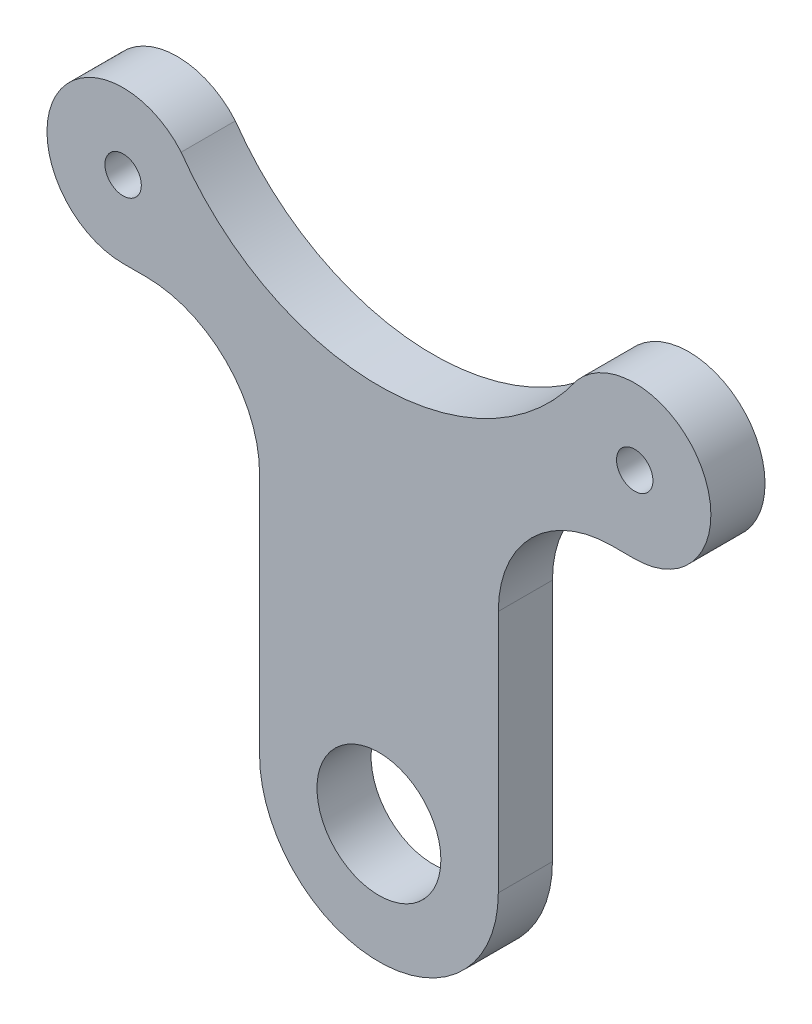
ISO-10303-21;
HEADER;
FILE_DESCRIPTION(('STEP AP214'),'2;1');
FILE_NAME('part.step','',(''),(''),'','','');
FILE_SCHEMA(('AUTOMOTIVE_DESIGN { 1 0 10303 214 1 1 1 1 }'));
ENDSEC;
DATA;
#1=APPLICATION_CONTEXT('core data for automotive mechanical design processes');
#2=APPLICATION_PROTOCOL_DEFINITION('international standard','automotive_design',2000,#1);
#3=PRODUCT_CONTEXT('',#1,'mechanical');
#4=PRODUCT('Part','Part','',(#3));
#5=PRODUCT_RELATED_PRODUCT_CATEGORY('part','',(#4));
#6=PRODUCT_DEFINITION_FORMATION('','',#4);
#7=PRODUCT_DEFINITION_CONTEXT('part definition',#1,'design');
#8=PRODUCT_DEFINITION('design','',#6,#7);
#9=PRODUCT_DEFINITION_SHAPE('','',#8);
#10=(LENGTH_UNIT() NAMED_UNIT(*) SI_UNIT(.MILLI.,.METRE.));
#11=(NAMED_UNIT(*) PLANE_ANGLE_UNIT() SI_UNIT($,.RADIAN.));
#12=(NAMED_UNIT(*) SI_UNIT($,.STERADIAN.) SOLID_ANGLE_UNIT());
#13=UNCERTAINTY_MEASURE_WITH_UNIT(LENGTH_MEASURE(1.E-05),#10,'distance_accuracy_value','');
#14=(GEOMETRIC_REPRESENTATION_CONTEXT(3) GLOBAL_UNCERTAINTY_ASSIGNED_CONTEXT((#13)) GLOBAL_UNIT_ASSIGNED_CONTEXT((#10,
#11,#12)) REPRESENTATION_CONTEXT('',''));
#15=CARTESIAN_POINT('',(0.,0.,0.));
#16=DIRECTION('',(0.,0.,1.));
#17=DIRECTION('',(1.,0.,0.));
#18=AXIS2_PLACEMENT_3D('',#15,#16,#17);
#19=CARTESIAN_POINT('',(0.,31.439339413153,4.763));
#20=DIRECTION('',(0.,1.,0.));
#21=DIRECTION('',(0.,0.,1.));
#22=AXIS2_PLACEMENT_3D('',#19,#20,#21);
#23=PLANE('',#22);
#24=DIRECTION('',(1.,0.,0.));
#25=VECTOR('',#24,1.);
#26=CARTESIAN_POINT('',(0.,31.439339413153,0.));
#27=LINE('',#26,#25);
#28=CARTESIAN_POINT('',(20.5,31.439339413153,0.));
#29=VERTEX_POINT('',#28);
#30=CARTESIAN_POINT('',(22.5,31.439339413153,0.));
#31=VERTEX_POINT('',#30);
#32=EDGE_CURVE('E160',#29,#31,#27,.T.);
#33=ORIENTED_EDGE('',*,*,#32,.T.);
#34=DIRECTION('',(0.,0.,-1.));
#35=VECTOR('',#34,1.);
#36=CARTESIAN_POINT('',(22.5,31.439339413153,4.763));
#37=LINE('',#36,#35);
#38=CARTESIAN_POINT('',(22.5,31.439339413153,4.763));
#39=VERTEX_POINT('',#38);
#40=EDGE_CURVE('E12',#39,#31,#37,.T.);
#41=ORIENTED_EDGE('',*,*,#40,.F.);
#42=DIRECTION('',(1.,0.,0.));
#43=VECTOR('',#42,1.);
#44=CARTESIAN_POINT('',(0.,31.439339413153,4.763));
#45=LINE('',#44,#43);
#46=CARTESIAN_POINT('',(20.5,31.439339413153,4.763));
#47=VERTEX_POINT('',#46);
#48=EDGE_CURVE('E189',#47,#39,#45,.T.);
#49=ORIENTED_EDGE('',*,*,#48,.F.);
#50=DIRECTION('',(0.,0.,-1.));
#51=VECTOR('',#50,1.);
#52=CARTESIAN_POINT('',(20.5,31.439339413153,4.763));
#53=LINE('',#52,#51);
#54=EDGE_CURVE('E151',#47,#29,#53,.T.);
#55=ORIENTED_EDGE('',*,*,#54,.T.);
#56=EDGE_LOOP('',(#33,#41,#49,#55));
#57=FACE_BOUND('',#56,.T.);
#58=ADVANCED_FACE('F46',(#57),#23,.F.);
#59=CARTESIAN_POINT('',(22.5,38.139339413153,4.763));
#60=DIRECTION('',(0.,0.,-1.));
#61=DIRECTION('',(-1.,0.,0.));
#62=AXIS2_PLACEMENT_3D('',#59,#60,#61);
#63=CYLINDRICAL_SURFACE('',#62,6.7);
#64=CARTESIAN_POINT('',(22.5,38.139339413153,0.));
#65=DIRECTION('',(0.,0.,1.));
#66=DIRECTION('',(1.,0.,0.));
#67=AXIS2_PLACEMENT_3D('',#64,#65,#66);
#68=CIRCLE('',#67,6.7);
#69=CARTESIAN_POINT('',(17.3951551088407,42.4787585721193,0.));
#70=VERTEX_POINT('',#69);
#71=EDGE_CURVE('E231',#31,#70,#68,.T.);
#72=ORIENTED_EDGE('',*,*,#71,.T.);
#73=DIRECTION('',(0.,0.,-1.));
#74=VECTOR('',#73,1.);
#75=CARTESIAN_POINT('',(17.3951551088407,42.4787585721193,4.763));
#76=LINE('',#75,#74);
#77=CARTESIAN_POINT('',(17.3951551088407,42.4787585721193,4.763));
#78=VERTEX_POINT('',#77);
#79=EDGE_CURVE('E55',#78,#70,#76,.T.);
#80=ORIENTED_EDGE('',*,*,#79,.F.);
#81=CARTESIAN_POINT('',(22.5,38.139339413153,4.763));
#82=DIRECTION('',(0.,0.,1.));
#83=DIRECTION('',(1.,0.,0.));
#84=AXIS2_PLACEMENT_3D('',#81,#82,#83);
#85=CIRCLE('',#84,6.7);
#86=EDGE_CURVE('E108',#39,#78,#85,.T.);
#87=ORIENTED_EDGE('',*,*,#86,.F.);
#88=ORIENTED_EDGE('',*,*,#40,.T.);
#89=EDGE_LOOP('',(#72,#80,#87,#88));
#90=FACE_BOUND('',#89,.T.);
#91=ADVANCED_FACE('F232',(#90),#63,.T.);
#92=CARTESIAN_POINT('',(0.,54.5440320324155,4.763));
#93=DIRECTION('',(0.,0.,-1.));
#94=DIRECTION('',(-1.,0.,0.));
#95=AXIS2_PLACEMENT_3D('',#92,#93,#94);
#96=CYLINDRICAL_SURFACE('',#95,21.1698428178471);
#97=CARTESIAN_POINT('',(0.,54.5440320324155,0.));
#98=DIRECTION('',(0.,0.,1.));
#99=DIRECTION('',(1.,0.,0.));
#100=AXIS2_PLACEMENT_3D('',#97,#98,#99);
#101=CIRCLE('',#100,21.1698428178471);
#102=CARTESIAN_POINT('',(-17.3951551088407,42.4787585721194,0.));
#103=VERTEX_POINT('',#102);
#104=EDGE_CURVE('E230',#103,#70,#101,.T.);
#105=ORIENTED_EDGE('',*,*,#104,.F.);
#106=DIRECTION('',(0.,0.,-1.));
#107=VECTOR('',#106,1.);
#108=CARTESIAN_POINT('',(-17.3951551088407,42.4787585721194,4.763));
#109=LINE('',#108,#107);
#110=CARTESIAN_POINT('',(-17.3951551088407,42.4787585721194,4.763));
#111=VERTEX_POINT('',#110);
#112=EDGE_CURVE('E220',#111,#103,#109,.T.);
#113=ORIENTED_EDGE('',*,*,#112,.F.);
#114=CARTESIAN_POINT('',(0.,54.5440320324155,4.763));
#115=DIRECTION('',(0.,0.,1.));
#116=DIRECTION('',(1.,0.,0.));
#117=AXIS2_PLACEMENT_3D('',#114,#115,#116);
#118=CIRCLE('',#117,21.1698428178471);
#119=EDGE_CURVE('E192',#111,#78,#118,.T.);
#120=ORIENTED_EDGE('',*,*,#119,.T.);
#121=ORIENTED_EDGE('',*,*,#79,.T.);
#122=EDGE_LOOP('',(#105,#113,#120,#121));
#123=FACE_BOUND('',#122,.T.);
#124=ADVANCED_FACE('F228',(#123),#96,.F.);
#125=CARTESIAN_POINT('',(-22.5,38.139339413153,4.763));
#126=DIRECTION('',(0.,0.,-1.));
#127=DIRECTION('',(-1.,0.,0.));
#128=AXIS2_PLACEMENT_3D('',#125,#126,#127);
#129=CYLINDRICAL_SURFACE('',#128,6.7);
#130=CARTESIAN_POINT('',(-22.5,38.139339413153,0.));
#131=DIRECTION('',(0.,0.,1.));
#132=DIRECTION('',(1.,0.,0.));
#133=AXIS2_PLACEMENT_3D('',#130,#131,#132);
#134=CIRCLE('',#133,6.7);
#135=CARTESIAN_POINT('',(-22.5,31.439339413153,0.));
#136=VERTEX_POINT('',#135);
#137=EDGE_CURVE('E240',#103,#136,#134,.T.);
#138=ORIENTED_EDGE('',*,*,#137,.T.);
#139=DIRECTION('',(0.,0.,-1.));
#140=VECTOR('',#139,1.);
#141=CARTESIAN_POINT('',(-22.5,31.439339413153,4.763));
#142=LINE('',#141,#140);
#143=CARTESIAN_POINT('',(-22.5,31.439339413153,4.763));
#144=VERTEX_POINT('',#143);
#145=EDGE_CURVE('E218',#144,#136,#142,.T.);
#146=ORIENTED_EDGE('',*,*,#145,.F.);
#147=CARTESIAN_POINT('',(-22.5,38.139339413153,4.763));
#148=DIRECTION('',(0.,0.,1.));
#149=DIRECTION('',(1.,0.,0.));
#150=AXIS2_PLACEMENT_3D('',#147,#148,#149);
#151=CIRCLE('',#150,6.7);
#152=EDGE_CURVE('E195',#111,#144,#151,.T.);
#153=ORIENTED_EDGE('',*,*,#152,.F.);
#154=ORIENTED_EDGE('',*,*,#112,.T.);
#155=EDGE_LOOP('',(#138,#146,#153,#154));
#156=FACE_BOUND('',#155,.T.);
#157=ADVANCED_FACE('F301',(#156),#129,.T.);
#158=CARTESIAN_POINT('',(0.,31.439339413153,4.763));
#159=DIRECTION('',(0.,1.,0.));
#160=DIRECTION('',(0.,0.,1.));
#161=AXIS2_PLACEMENT_3D('',#158,#159,#160);
#162=PLANE('',#161);
#163=DIRECTION('',(1.,0.,0.));
#164=VECTOR('',#163,1.);
#165=CARTESIAN_POINT('',(0.,31.439339413153,0.));
#166=LINE('',#165,#164);
#167=CARTESIAN_POINT('',(-20.5,31.439339413153,0.));
#168=VERTEX_POINT('',#167);
#169=EDGE_CURVE('E216',#136,#168,#166,.T.);
#170=ORIENTED_EDGE('',*,*,#169,.T.);
#171=DIRECTION('',(0.,0.,-1.));
#172=VECTOR('',#171,1.);
#173=CARTESIAN_POINT('',(-20.5,31.439339413153,4.763));
#174=LINE('',#173,#172);
#175=CARTESIAN_POINT('',(-20.5,31.439339413153,4.763));
#176=VERTEX_POINT('',#175);
#177=EDGE_CURVE('E205',#176,#168,#174,.T.);
#178=ORIENTED_EDGE('',*,*,#177,.F.);
#179=DIRECTION('',(1.,0.,0.));
#180=VECTOR('',#179,1.);
#181=CARTESIAN_POINT('',(0.,31.439339413153,4.763));
#182=LINE('',#181,#180);
#183=EDGE_CURVE('E197',#144,#176,#182,.T.);
#184=ORIENTED_EDGE('',*,*,#183,.F.);
#185=ORIENTED_EDGE('',*,*,#145,.T.);
#186=EDGE_LOOP('',(#170,#178,#184,#185));
#187=FACE_BOUND('',#186,.T.);
#188=ADVANCED_FACE('F214',(#187),#162,.F.);
#189=CARTESIAN_POINT('',(-20.5,21.439339413153,4.763));
#190=DIRECTION('',(0.,0.,-1.));
#191=DIRECTION('',(-1.,0.,0.));
#192=AXIS2_PLACEMENT_3D('',#189,#190,#191);
#193=CYLINDRICAL_SURFACE('',#192,10.);
#194=CARTESIAN_POINT('',(-20.5,21.439339413153,0.));
#195=DIRECTION('',(0.,0.,1.));
#196=DIRECTION('',(1.,0.,0.));
#197=AXIS2_PLACEMENT_3D('',#194,#195,#196);
#198=CIRCLE('',#197,10.);
#199=CARTESIAN_POINT('',(-10.5,21.439339413153,0.));
#200=VERTEX_POINT('',#199);
#201=EDGE_CURVE('E259',#200,#168,#198,.T.);
#202=ORIENTED_EDGE('',*,*,#201,.F.);
#203=DIRECTION('',(0.,0.,-1.));
#204=VECTOR('',#203,1.);
#205=CARTESIAN_POINT('',(-10.5,21.439339413153,4.763));
#206=LINE('',#205,#204);
#207=CARTESIAN_POINT('',(-10.5,21.439339413153,4.763));
#208=VERTEX_POINT('',#207);
#209=EDGE_CURVE('E207',#208,#200,#206,.T.);
#210=ORIENTED_EDGE('',*,*,#209,.F.);
#211=CARTESIAN_POINT('',(-20.5,21.439339413153,4.763));
#212=DIRECTION('',(0.,0.,1.));
#213=DIRECTION('',(1.,0.,0.));
#214=AXIS2_PLACEMENT_3D('',#211,#212,#213);
#215=CIRCLE('',#214,10.);
#216=EDGE_CURVE('E199',#208,#176,#215,.T.);
#217=ORIENTED_EDGE('',*,*,#216,.T.);
#218=ORIENTED_EDGE('',*,*,#177,.T.);
#219=EDGE_LOOP('',(#202,#210,#217,#218));
#220=FACE_BOUND('',#219,.T.);
#221=ADVANCED_FACE('F203',(#220),#193,.F.);
#222=CARTESIAN_POINT('',(-10.5,0.,4.763));
#223=DIRECTION('',(1.,0.,0.));
#224=DIRECTION('',(0.,1.,0.));
#225=AXIS2_PLACEMENT_3D('',#222,#223,#224);
#226=PLANE('',#225);
#227=DIRECTION('',(0.,-1.,0.));
#228=VECTOR('',#227,1.);
#229=CARTESIAN_POINT('',(-10.5,0.,0.));
#230=LINE('',#229,#228);
#231=CARTESIAN_POINT('',(-10.5,0.,0.));
#232=VERTEX_POINT('',#231);
#233=EDGE_CURVE('E263',#200,#232,#230,.T.);
#234=ORIENTED_EDGE('',*,*,#233,.T.);
#235=DIRECTION('',(0.,0.,-1.));
#236=VECTOR('',#235,1.);
#237=CARTESIAN_POINT('',(-10.5,0.,4.763));
#238=LINE('',#237,#236);
#239=CARTESIAN_POINT('',(-10.5,0.,4.763));
#240=VERTEX_POINT('',#239);
#241=EDGE_CURVE('E147',#240,#232,#238,.T.);
#242=ORIENTED_EDGE('',*,*,#241,.F.);
#243=DIRECTION('',(0.,-1.,0.));
#244=VECTOR('',#243,1.);
#245=CARTESIAN_POINT('',(-10.5,0.,4.763));
#246=LINE('',#245,#244);
#247=EDGE_CURVE('E134',#208,#240,#246,.T.);
#248=ORIENTED_EDGE('',*,*,#247,.F.);
#249=ORIENTED_EDGE('',*,*,#209,.T.);
#250=EDGE_LOOP('',(#234,#242,#248,#249));
#251=FACE_BOUND('',#250,.T.);
#252=ADVANCED_FACE('F309',(#251),#226,.F.);
#253=CARTESIAN_POINT('',(0.,0.,4.763));
#254=DIRECTION('',(0.,0.,-1.));
#255=DIRECTION('',(-1.,0.,0.));
#256=AXIS2_PLACEMENT_3D('',#253,#254,#255);
#257=CYLINDRICAL_SURFACE('',#256,10.5);
#258=CARTESIAN_POINT('',(0.,0.,0.));
#259=DIRECTION('',(0.,0.,1.));
#260=DIRECTION('',(1.,0.,0.));
#261=AXIS2_PLACEMENT_3D('',#258,#259,#260);
#262=CIRCLE('',#261,10.5);
#263=CARTESIAN_POINT('',(10.5,0.,0.));
#264=VERTEX_POINT('',#263);
#265=EDGE_CURVE('E143',#232,#264,#262,.T.);
#266=ORIENTED_EDGE('',*,*,#265,.T.);
#267=DIRECTION('',(0.,0.,-1.));
#268=VECTOR('',#267,1.);
#269=CARTESIAN_POINT('',(10.5,0.,4.763));
#270=LINE('',#269,#268);
#271=CARTESIAN_POINT('',(10.5,0.,4.763));
#272=VERTEX_POINT('',#271);
#273=EDGE_CURVE('E140',#272,#264,#270,.T.);
#274=ORIENTED_EDGE('',*,*,#273,.F.);
#275=CARTESIAN_POINT('',(0.,0.,4.763));
#276=DIRECTION('',(0.,0.,1.));
#277=DIRECTION('',(1.,0.,0.));
#278=AXIS2_PLACEMENT_3D('',#275,#276,#277);
#279=CIRCLE('',#278,10.5);
#280=EDGE_CURVE('E127',#240,#272,#279,.T.);
#281=ORIENTED_EDGE('',*,*,#280,.F.);
#282=ORIENTED_EDGE('',*,*,#241,.T.);
#283=EDGE_LOOP('',(#266,#274,#281,#282));
#284=FACE_BOUND('',#283,.T.);
#285=ADVANCED_FACE('F141',(#284),#257,.T.);
#286=CARTESIAN_POINT('',(10.5,0.,4.763));
#287=DIRECTION('',(1.,0.,0.));
#288=DIRECTION('',(0.,1.,0.));
#289=AXIS2_PLACEMENT_3D('',#286,#287,#288);
#290=PLANE('',#289);
#291=DIRECTION('',(0.,-1.,0.));
#292=VECTOR('',#291,1.);
#293=CARTESIAN_POINT('',(10.5,0.,0.));
#294=LINE('',#293,#292);
#295=CARTESIAN_POINT('',(10.5,21.439339413153,0.));
#296=VERTEX_POINT('',#295);
#297=EDGE_CURVE('E269',#296,#264,#294,.T.);
#298=ORIENTED_EDGE('',*,*,#297,.F.);
#299=DIRECTION('',(0.,0.,-1.));
#300=VECTOR('',#299,1.);
#301=CARTESIAN_POINT('',(10.5,21.439339413153,4.763));
#302=LINE('',#301,#300);
#303=CARTESIAN_POINT('',(10.5,21.439339413153,4.763));
#304=VERTEX_POINT('',#303);
#305=EDGE_CURVE('E97',#304,#296,#302,.T.);
#306=ORIENTED_EDGE('',*,*,#305,.F.);
#307=DIRECTION('',(0.,-1.,0.));
#308=VECTOR('',#307,1.);
#309=CARTESIAN_POINT('',(10.5,0.,4.763));
#310=LINE('',#309,#308);
#311=EDGE_CURVE('E131',#304,#272,#310,.T.);
#312=ORIENTED_EDGE('',*,*,#311,.T.);
#313=ORIENTED_EDGE('',*,*,#273,.T.);
#314=EDGE_LOOP('',(#298,#306,#312,#313));
#315=FACE_BOUND('',#314,.T.);
#316=ADVANCED_FACE('F149',(#315),#290,.T.);
#317=CARTESIAN_POINT('',(0.,0.,4.763));
#318=DIRECTION('',(0.,0.,-1.));
#319=DIRECTION('',(-1.,0.,0.));
#320=AXIS2_PLACEMENT_3D('',#317,#318,#319);
#321=CYLINDRICAL_SURFACE('',#320,5.44942);
#322=CARTESIAN_POINT('',(0.,0.,4.763));
#323=DIRECTION('',(0.,0.,1.));
#324=DIRECTION('',(1.,0.,0.));
#325=AXIS2_PLACEMENT_3D('',#322,#323,#324);
#326=CIRCLE('',#325,5.44942);
#327=CARTESIAN_POINT('',(5.44942,0.,4.763));
#328=VERTEX_POINT('',#327);
#329=EDGE_CURVE('E186',#328,#328,#326,.T.);
#330=ORIENTED_EDGE('',*,*,#329,.T.);
#331=EDGE_LOOP('',(#330));
#332=FACE_BOUND('',#331,.T.);
#333=CARTESIAN_POINT('',(0.,0.,0.));
#334=DIRECTION('',(0.,0.,1.));
#335=DIRECTION('',(1.,0.,0.));
#336=AXIS2_PLACEMENT_3D('',#333,#334,#335);
#337=CIRCLE('',#336,5.44942);
#338=CARTESIAN_POINT('',(5.44942,0.,0.));
#339=VERTEX_POINT('',#338);
#340=EDGE_CURVE('E155',#339,#339,#337,.T.);
#341=ORIENTED_EDGE('',*,*,#340,.F.);
#342=EDGE_LOOP('',(#341));
#343=FACE_BOUND('',#342,.T.);
#344=ADVANCED_FACE('F48',(#332,#343),#321,.F.);
#345=CARTESIAN_POINT('',(20.5,21.439339413153,4.763));
#346=DIRECTION('',(0.,0.,-1.));
#347=DIRECTION('',(-1.,0.,0.));
#348=AXIS2_PLACEMENT_3D('',#345,#346,#347);
#349=CYLINDRICAL_SURFACE('',#348,10.);
#350=CARTESIAN_POINT('',(20.5,21.439339413153,0.));
#351=DIRECTION('',(0.,0.,1.));
#352=DIRECTION('',(1.,0.,0.));
#353=AXIS2_PLACEMENT_3D('',#350,#351,#352);
#354=CIRCLE('',#353,10.);
#355=EDGE_CURVE('E100',#296,#29,#354,.F.);
#356=ORIENTED_EDGE('',*,*,#355,.T.);
#357=ORIENTED_EDGE('',*,*,#54,.F.);
#358=CARTESIAN_POINT('',(20.5,21.439339413153,4.763));
#359=DIRECTION('',(0.,0.,1.));
#360=DIRECTION('',(1.,0.,0.));
#361=AXIS2_PLACEMENT_3D('',#358,#359,#360);
#362=CIRCLE('',#361,10.);
#363=EDGE_CURVE('E63',#304,#47,#362,.F.);
#364=ORIENTED_EDGE('',*,*,#363,.F.);
#365=ORIENTED_EDGE('',*,*,#305,.T.);
#366=EDGE_LOOP('',(#356,#357,#364,#365));
#367=FACE_BOUND('',#366,.T.);
#368=ADVANCED_FACE('F281',(#367),#349,.F.);
#369=CARTESIAN_POINT('',(0.,0.,4.763));
#370=DIRECTION('',(0.,0.,1.));
#371=DIRECTION('',(1.,0.,0.));
#372=AXIS2_PLACEMENT_3D('',#369,#370,#371);
#373=PLANE('',#372);
#374=CARTESIAN_POINT('',(-22.5,38.1958916178117,4.763));
#375=DIRECTION('',(0.,0.,1.));
#376=DIRECTION('',(1.,0.,0.));
#377=AXIS2_PLACEMENT_3D('',#374,#375,#376);
#378=CIRCLE('',#377,1.6);
#379=CARTESIAN_POINT('',(-20.9,38.1958916178117,4.763));
#380=VERTEX_POINT('',#379);
#381=EDGE_CURVE('E180',#380,#380,#378,.T.);
#382=ORIENTED_EDGE('',*,*,#381,.F.);
#383=EDGE_LOOP('',(#382));
#384=FACE_BOUND('',#383,.T.);
#385=CARTESIAN_POINT('',(22.5,38.1958916178117,4.763));
#386=DIRECTION('',(0.,0.,1.));
#387=DIRECTION('',(1.,0.,0.));
#388=AXIS2_PLACEMENT_3D('',#385,#386,#387);
#389=CIRCLE('',#388,1.6);
#390=CARTESIAN_POINT('',(24.1,38.1958916178117,4.763));
#391=VERTEX_POINT('',#390);
#392=EDGE_CURVE('E179',#391,#391,#389,.T.);
#393=ORIENTED_EDGE('',*,*,#392,.F.);
#394=EDGE_LOOP('',(#393));
#395=FACE_BOUND('',#394,.T.);
#396=ORIENTED_EDGE('',*,*,#329,.F.);
#397=EDGE_LOOP('',(#396));
#398=FACE_BOUND('',#397,.T.);
#399=ORIENTED_EDGE('',*,*,#48,.T.);
#400=ORIENTED_EDGE('',*,*,#86,.T.);
#401=ORIENTED_EDGE('',*,*,#119,.F.);
#402=ORIENTED_EDGE('',*,*,#152,.T.);
#403=ORIENTED_EDGE('',*,*,#183,.T.);
#404=ORIENTED_EDGE('',*,*,#216,.F.);
#405=ORIENTED_EDGE('',*,*,#247,.T.);
#406=ORIENTED_EDGE('',*,*,#280,.T.);
#407=ORIENTED_EDGE('',*,*,#311,.F.);
#408=ORIENTED_EDGE('',*,*,#363,.T.);
#409=EDGE_LOOP('',(#399,#400,#401,#402,#403,#404,#405,#406,#407,#408));
#410=FACE_BOUND('',#409,.T.);
#411=ADVANCED_FACE('F129',(#384,#395,#398,#410),#373,.T.);
#412=CARTESIAN_POINT('',(0.,0.,0.));
#413=DIRECTION('',(0.,0.,1.));
#414=DIRECTION('',(1.,0.,0.));
#415=AXIS2_PLACEMENT_3D('',#412,#413,#414);
#416=PLANE('',#415);
#417=CARTESIAN_POINT('',(-22.5,38.1958916178117,0.));
#418=DIRECTION('',(0.,0.,1.));
#419=DIRECTION('',(1.,0.,0.));
#420=AXIS2_PLACEMENT_3D('',#417,#418,#419);
#421=CIRCLE('',#420,1.6);
#422=CARTESIAN_POINT('',(-20.9,38.1958916178117,0.));
#423=VERTEX_POINT('',#422);
#424=EDGE_CURVE('E173',#423,#423,#421,.T.);
#425=ORIENTED_EDGE('',*,*,#424,.T.);
#426=EDGE_LOOP('',(#425));
#427=FACE_BOUND('',#426,.T.);
#428=CARTESIAN_POINT('',(22.5,38.1958916178117,0.));
#429=DIRECTION('',(0.,0.,1.));
#430=DIRECTION('',(1.,0.,0.));
#431=AXIS2_PLACEMENT_3D('',#428,#429,#430);
#432=CIRCLE('',#431,1.6);
#433=CARTESIAN_POINT('',(24.1,38.1958916178117,0.));
#434=VERTEX_POINT('',#433);
#435=EDGE_CURVE('E161',#434,#434,#432,.T.);
#436=ORIENTED_EDGE('',*,*,#435,.T.);
#437=EDGE_LOOP('',(#436));
#438=FACE_BOUND('',#437,.T.);
#439=ORIENTED_EDGE('',*,*,#340,.T.);
#440=EDGE_LOOP('',(#439));
#441=FACE_BOUND('',#440,.T.);
#442=ORIENTED_EDGE('',*,*,#32,.F.);
#443=ORIENTED_EDGE('',*,*,#355,.F.);
#444=ORIENTED_EDGE('',*,*,#297,.T.);
#445=ORIENTED_EDGE('',*,*,#265,.F.);
#446=ORIENTED_EDGE('',*,*,#233,.F.);
#447=ORIENTED_EDGE('',*,*,#201,.T.);
#448=ORIENTED_EDGE('',*,*,#169,.F.);
#449=ORIENTED_EDGE('',*,*,#137,.F.);
#450=ORIENTED_EDGE('',*,*,#104,.T.);
#451=ORIENTED_EDGE('',*,*,#71,.F.);
#452=EDGE_LOOP('',(#442,#443,#444,#445,#446,#447,#448,#449,#450,#451));
#453=FACE_BOUND('',#452,.T.);
#454=ADVANCED_FACE('F239',(#427,#438,#441,#453),#416,.F.);
#455=CARTESIAN_POINT('',(22.5,38.1958916178117,4.763));
#456=DIRECTION('',(0.,0.,1.));
#457=DIRECTION('',(1.,0.,0.));
#458=AXIS2_PLACEMENT_3D('',#455,#456,#457);
#459=CYLINDRICAL_SURFACE('',#458,1.6);
#460=ORIENTED_EDGE('',*,*,#435,.F.);
#461=EDGE_LOOP('',(#460));
#462=FACE_BOUND('',#461,.T.);
#463=ORIENTED_EDGE('',*,*,#392,.T.);
#464=EDGE_LOOP('',(#463));
#465=FACE_BOUND('',#464,.T.);
#466=ADVANCED_FACE('F343',(#462,#465),#459,.F.);
#467=CARTESIAN_POINT('',(-22.5,38.1958916178117,4.763));
#468=DIRECTION('',(0.,0.,1.));
#469=DIRECTION('',(1.,0.,0.));
#470=AXIS2_PLACEMENT_3D('',#467,#468,#469);
#471=CYLINDRICAL_SURFACE('',#470,1.6);
#472=ORIENTED_EDGE('',*,*,#424,.F.);
#473=EDGE_LOOP('',(#472));
#474=FACE_BOUND('',#473,.T.);
#475=ORIENTED_EDGE('',*,*,#381,.T.);
#476=EDGE_LOOP('',(#475));
#477=FACE_BOUND('',#476,.T.);
#478=ADVANCED_FACE('F353',(#474,#477),#471,.F.);
#479=CLOSED_SHELL('',(#58,#91,#124,#157,#188,#221,#252,#285,#316,#344,#368,#411,#454,#466,#478));
#480=MANIFOLD_SOLID_BREP('B2',#479);
#481=ADVANCED_BREP_SHAPE_REPRESENTATION('',(#18,#480),#14);
#482=SHAPE_DEFINITION_REPRESENTATION(#9,#481);
ENDSEC;
END-ISO-10303-21;
